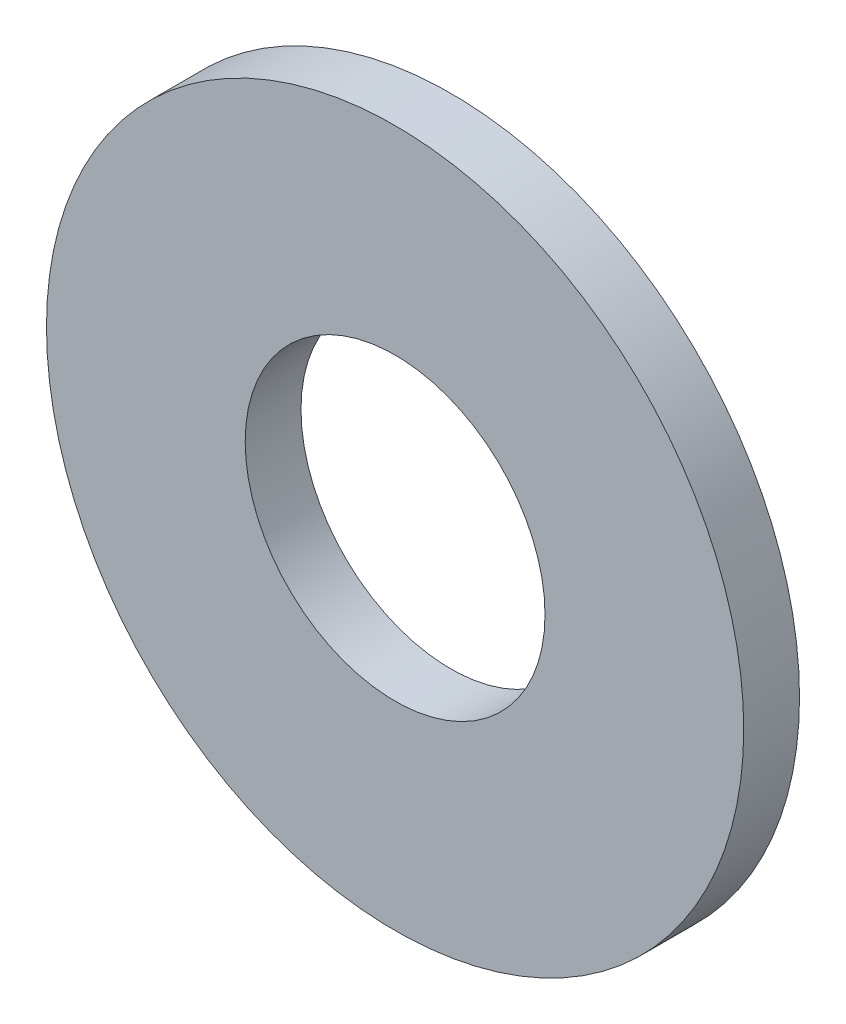
ISO-10303-21;
HEADER;
FILE_DESCRIPTION(('STEP AP214'),'2;1');
FILE_NAME('part.step','',(''),(''),'','','');
FILE_SCHEMA(('AUTOMOTIVE_DESIGN { 1 0 10303 214 1 1 1 1 }'));
ENDSEC;
DATA;
#1=APPLICATION_CONTEXT('core data for automotive mechanical design processes');
#2=APPLICATION_PROTOCOL_DEFINITION('international standard','automotive_design',2000,#1);
#3=PRODUCT_CONTEXT('',#1,'mechanical');
#4=PRODUCT('Part','Part','',(#3));
#5=PRODUCT_RELATED_PRODUCT_CATEGORY('part','',(#4));
#6=PRODUCT_DEFINITION_FORMATION('','',#4);
#7=PRODUCT_DEFINITION_CONTEXT('part definition',#1,'design');
#8=PRODUCT_DEFINITION('design','',#6,#7);
#9=PRODUCT_DEFINITION_SHAPE('','',#8);
#10=(LENGTH_UNIT() NAMED_UNIT(*) SI_UNIT(.MILLI.,.METRE.));
#11=(NAMED_UNIT(*) PLANE_ANGLE_UNIT() SI_UNIT($,.RADIAN.));
#12=(NAMED_UNIT(*) SI_UNIT($,.STERADIAN.) SOLID_ANGLE_UNIT());
#13=UNCERTAINTY_MEASURE_WITH_UNIT(LENGTH_MEASURE(1.E-05),#10,'distance_accuracy_value','');
#14=(GEOMETRIC_REPRESENTATION_CONTEXT(3) GLOBAL_UNCERTAINTY_ASSIGNED_CONTEXT((#13)) GLOBAL_UNIT_ASSIGNED_CONTEXT((#10,
#11,#12)) REPRESENTATION_CONTEXT('',''));
#15=CARTESIAN_POINT('',(0.,0.,0.));
#16=DIRECTION('',(0.,0.,1.));
#17=DIRECTION('',(1.,0.,0.));
#18=AXIS2_PLACEMENT_3D('',#15,#16,#17);
#19=CARTESIAN_POINT('',(0.,0.,0.8));
#20=DIRECTION('',(0.,0.,1.));
#21=DIRECTION('',(1.,0.,0.));
#22=AXIS2_PLACEMENT_3D('',#19,#20,#21);
#23=PLANE('',#22);
#24=CARTESIAN_POINT('',(0.,0.,0.8));
#25=DIRECTION('',(0.,0.,1.));
#26=DIRECTION('',(1.,0.,0.));
#27=AXIS2_PLACEMENT_3D('',#24,#25,#26);
#28=CIRCLE('',#27,5.);
#29=CARTESIAN_POINT('',(5.,0.,0.8));
#30=VERTEX_POINT('',#29);
#31=EDGE_CURVE('E10',#30,#30,#28,.T.);
#32=ORIENTED_EDGE('',*,*,#31,.T.);
#33=EDGE_LOOP('',(#32));
#34=FACE_BOUND('',#33,.T.);
#35=CARTESIAN_POINT('',(0.,0.,0.8));
#36=DIRECTION('',(0.,0.,1.));
#37=DIRECTION('',(1.,0.,0.));
#38=AXIS2_PLACEMENT_3D('',#35,#36,#37);
#39=CIRCLE('',#38,2.15);
#40=CARTESIAN_POINT('',(2.15,0.,0.8));
#41=VERTEX_POINT('',#40);
#42=EDGE_CURVE('E41',#41,#41,#39,.T.);
#43=ORIENTED_EDGE('',*,*,#42,.F.);
#44=EDGE_LOOP('',(#43));
#45=FACE_BOUND('',#44,.T.);
#46=ADVANCED_FACE('F30',(#34,#45),#23,.T.);
#47=CARTESIAN_POINT('',(0.,0.,0.));
#48=DIRECTION('',(0.,0.,1.));
#49=DIRECTION('',(1.,0.,0.));
#50=AXIS2_PLACEMENT_3D('',#47,#48,#49);
#51=PLANE('',#50);
#52=CARTESIAN_POINT('',(0.,0.,0.));
#53=DIRECTION('',(0.,0.,1.));
#54=DIRECTION('',(1.,0.,0.));
#55=AXIS2_PLACEMENT_3D('',#52,#53,#54);
#56=CIRCLE('',#55,5.);
#57=CARTESIAN_POINT('',(5.,0.,0.));
#58=VERTEX_POINT('',#57);
#59=EDGE_CURVE('E37',#58,#58,#56,.T.);
#60=ORIENTED_EDGE('',*,*,#59,.F.);
#61=EDGE_LOOP('',(#60));
#62=FACE_BOUND('',#61,.T.);
#63=CARTESIAN_POINT('',(0.,0.,0.));
#64=DIRECTION('',(0.,0.,1.));
#65=DIRECTION('',(1.,0.,0.));
#66=AXIS2_PLACEMENT_3D('',#63,#64,#65);
#67=CIRCLE('',#66,2.15);
#68=CARTESIAN_POINT('',(2.15,0.,0.));
#69=VERTEX_POINT('',#68);
#70=EDGE_CURVE('E45',#69,#69,#67,.T.);
#71=ORIENTED_EDGE('',*,*,#70,.T.);
#72=EDGE_LOOP('',(#71));
#73=FACE_BOUND('',#72,.T.);
#74=ADVANCED_FACE('F51',(#62,#73),#51,.F.);
#75=CARTESIAN_POINT('',(0.,0.,0.8));
#76=DIRECTION('',(0.,0.,-1.));
#77=DIRECTION('',(-1.,0.,0.));
#78=AXIS2_PLACEMENT_3D('',#75,#76,#77);
#79=CYLINDRICAL_SURFACE('',#78,5.);
#80=ORIENTED_EDGE('',*,*,#31,.F.);
#81=EDGE_LOOP('',(#80));
#82=FACE_BOUND('',#81,.T.);
#83=ORIENTED_EDGE('',*,*,#59,.T.);
#84=EDGE_LOOP('',(#83));
#85=FACE_BOUND('',#84,.T.);
#86=ADVANCED_FACE('F32',(#82,#85),#79,.T.);
#87=CARTESIAN_POINT('',(0.,0.,0.8));
#88=DIRECTION('',(0.,0.,-1.));
#89=DIRECTION('',(-1.,0.,0.));
#90=AXIS2_PLACEMENT_3D('',#87,#88,#89);
#91=CYLINDRICAL_SURFACE('',#90,2.15);
#92=ORIENTED_EDGE('',*,*,#42,.T.);
#93=EDGE_LOOP('',(#92));
#94=FACE_BOUND('',#93,.T.);
#95=ORIENTED_EDGE('',*,*,#70,.F.);
#96=EDGE_LOOP('',(#95));
#97=FACE_BOUND('',#96,.T.);
#98=ADVANCED_FACE('F53',(#94,#97),#91,.F.);
#99=CLOSED_SHELL('',(#46,#74,#86,#98));
#100=MANIFOLD_SOLID_BREP('B2',#99);
#101=ADVANCED_BREP_SHAPE_REPRESENTATION('',(#18,#100),#14);
#102=SHAPE_DEFINITION_REPRESENTATION(#9,#101);
ENDSEC;
END-ISO-10303-21;
